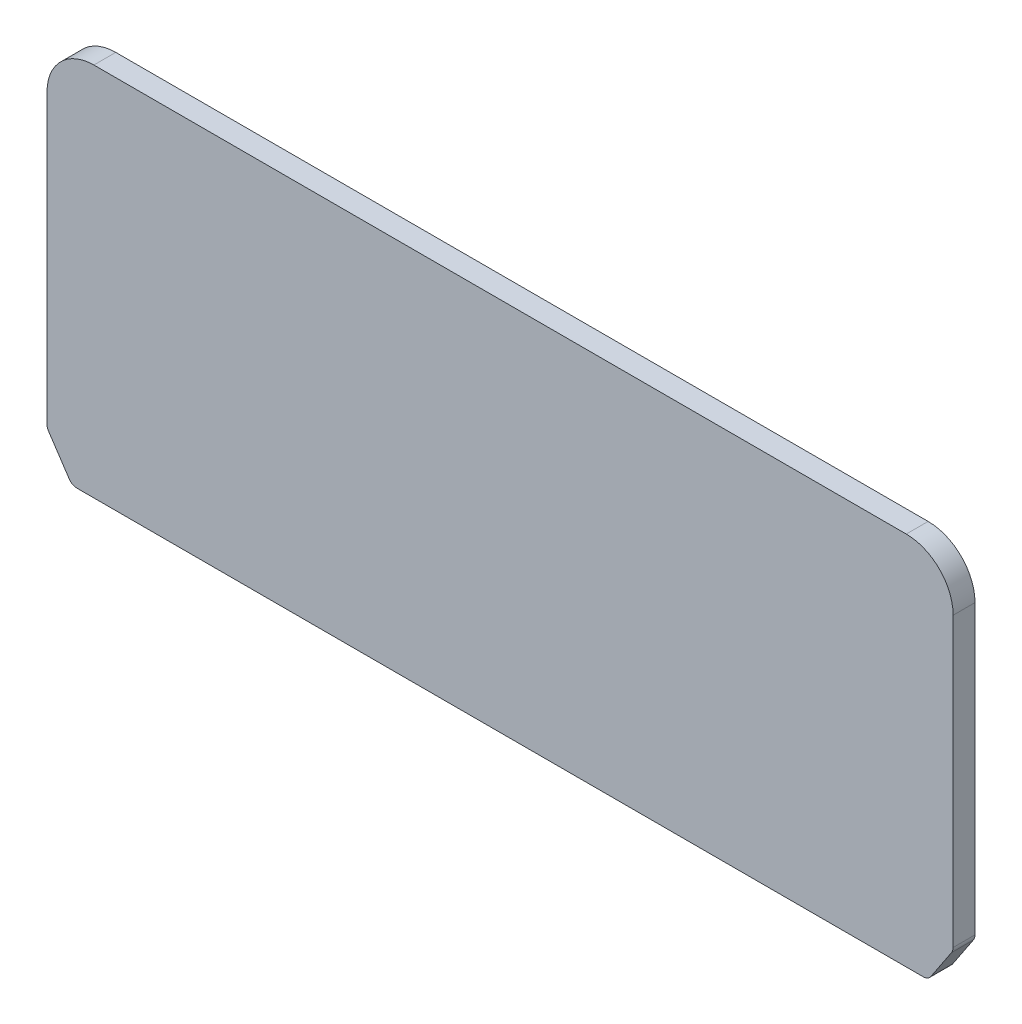
ISO-10303-21;
HEADER;
FILE_DESCRIPTION(('STEP AP214'),'2;1');
FILE_NAME('part.step','',(''),(''),'','','');
FILE_SCHEMA(('AUTOMOTIVE_DESIGN { 1 0 10303 214 1 1 1 1 }'));
ENDSEC;
DATA;
#1=APPLICATION_CONTEXT('core data for automotive mechanical design processes');
#2=APPLICATION_PROTOCOL_DEFINITION('international standard','automotive_design',2000,#1);
#3=PRODUCT_CONTEXT('',#1,'mechanical');
#4=PRODUCT('Part','Part','',(#3));
#5=PRODUCT_RELATED_PRODUCT_CATEGORY('part','',(#4));
#6=PRODUCT_DEFINITION_FORMATION('','',#4);
#7=PRODUCT_DEFINITION_CONTEXT('part definition',#1,'design');
#8=PRODUCT_DEFINITION('design','',#6,#7);
#9=PRODUCT_DEFINITION_SHAPE('','',#8);
#10=(LENGTH_UNIT() NAMED_UNIT(*) SI_UNIT(.MILLI.,.METRE.));
#11=(NAMED_UNIT(*) PLANE_ANGLE_UNIT() SI_UNIT($,.RADIAN.));
#12=(NAMED_UNIT(*) SI_UNIT($,.STERADIAN.) SOLID_ANGLE_UNIT());
#13=UNCERTAINTY_MEASURE_WITH_UNIT(LENGTH_MEASURE(1.E-05),#10,'distance_accuracy_value','');
#14=(GEOMETRIC_REPRESENTATION_CONTEXT(3) GLOBAL_UNCERTAINTY_ASSIGNED_CONTEXT((#13)) GLOBAL_UNIT_ASSIGNED_CONTEXT((#10,
#11,#12)) REPRESENTATION_CONTEXT('',''));
#15=CARTESIAN_POINT('',(0.,0.,0.));
#16=DIRECTION('',(0.,0.,1.));
#17=DIRECTION('',(1.,0.,0.));
#18=AXIS2_PLACEMENT_3D('',#15,#16,#17);
#19=CARTESIAN_POINT('',(-130.,105.,7.));
#20=DIRECTION('',(0.,0.,-1.));
#21=DIRECTION('',(-1.,0.,0.));
#22=AXIS2_PLACEMENT_3D('',#19,#20,#21);
#23=CYLINDRICAL_SURFACE('',#22,15.);
#24=CARTESIAN_POINT('',(-130.,105.,0.));
#25=DIRECTION('',(0.,0.,1.));
#26=DIRECTION('',(-1.,0.,0.));
#27=AXIS2_PLACEMENT_3D('',#24,#25,#26);
#28=CIRCLE('',#27,15.);
#29=CARTESIAN_POINT('',(-130.,120.,0.));
#30=VERTEX_POINT('',#29);
#31=CARTESIAN_POINT('',(-145.,105.,0.));
#32=VERTEX_POINT('',#31);
#33=EDGE_CURVE('E159',#30,#32,#28,.T.);
#34=ORIENTED_EDGE('',*,*,#33,.T.);
#35=DIRECTION('',(0.,0.,-1.));
#36=VECTOR('',#35,1.);
#37=CARTESIAN_POINT('',(-145.,105.,7.));
#38=LINE('',#37,#36);
#39=CARTESIAN_POINT('',(-145.,105.,7.));
#40=VERTEX_POINT('',#39);
#41=EDGE_CURVE('E11',#40,#32,#38,.T.);
#42=ORIENTED_EDGE('',*,*,#41,.F.);
#43=CARTESIAN_POINT('',(-130.,105.,7.));
#44=DIRECTION('',(0.,0.,1.));
#45=DIRECTION('',(-1.,0.,0.));
#46=AXIS2_PLACEMENT_3D('',#43,#44,#45);
#47=CIRCLE('',#46,15.);
#48=CARTESIAN_POINT('',(-130.,120.,7.));
#49=VERTEX_POINT('',#48);
#50=EDGE_CURVE('E181',#49,#40,#47,.T.);
#51=ORIENTED_EDGE('',*,*,#50,.F.);
#52=DIRECTION('',(0.,0.,-1.));
#53=VECTOR('',#52,1.);
#54=CARTESIAN_POINT('',(-130.,120.,7.));
#55=LINE('',#54,#53);
#56=EDGE_CURVE('E155',#49,#30,#55,.T.);
#57=ORIENTED_EDGE('',*,*,#56,.T.);
#58=EDGE_LOOP('',(#34,#42,#51,#57));
#59=FACE_BOUND('',#58,.T.);
#60=ADVANCED_FACE('F39',(#59),#23,.T.);
#61=CARTESIAN_POINT('',(-145.,12.908326913196,7.));
#62=DIRECTION('',(1.,0.,0.));
#63=DIRECTION('',(0.,1.,0.));
#64=AXIS2_PLACEMENT_3D('',#61,#62,#63);
#65=PLANE('',#64);
#66=DIRECTION('',(0.,-1.,0.));
#67=VECTOR('',#66,1.);
#68=CARTESIAN_POINT('',(-145.,12.908326913196,0.));
#69=LINE('',#68,#67);
#70=CARTESIAN_POINT('',(-145.,12.908326913196,0.));
#71=VERTEX_POINT('',#70);
#72=EDGE_CURVE('E162',#32,#71,#69,.T.);
#73=ORIENTED_EDGE('',*,*,#72,.T.);
#74=DIRECTION('',(0.,0.,-1.));
#75=VECTOR('',#74,1.);
#76=CARTESIAN_POINT('',(-145.,12.908326913196,7.));
#77=LINE('',#76,#75);
#78=CARTESIAN_POINT('',(-145.,12.908326913196,7.));
#79=VERTEX_POINT('',#78);
#80=EDGE_CURVE('E47',#79,#71,#77,.T.);
#81=ORIENTED_EDGE('',*,*,#80,.F.);
#82=DIRECTION('',(0.,-1.,0.));
#83=VECTOR('',#82,1.);
#84=CARTESIAN_POINT('',(-145.,12.908326913196,7.));
#85=LINE('',#84,#83);
#86=EDGE_CURVE('E110',#40,#79,#85,.T.);
#87=ORIENTED_EDGE('',*,*,#86,.F.);
#88=ORIENTED_EDGE('',*,*,#41,.T.);
#89=EDGE_LOOP('',(#73,#81,#87,#88));
#90=FACE_BOUND('',#89,.T.);
#91=ADVANCED_FACE('F259',(#90),#65,.F.);
#92=CARTESIAN_POINT('',(-142.,12.908326913196,7.));
#93=DIRECTION('',(0.,0.,-1.));
#94=DIRECTION('',(-1.,0.,0.));
#95=AXIS2_PLACEMENT_3D('',#92,#93,#94);
#96=CYLINDRICAL_SURFACE('',#95,3.);
#97=CARTESIAN_POINT('',(-142.,12.908326913196,0.));
#98=DIRECTION('',(0.,0.,1.));
#99=DIRECTION('',(-1.,0.,0.));
#100=AXIS2_PLACEMENT_3D('',#97,#98,#99);
#101=CIRCLE('',#100,3.);
#102=CARTESIAN_POINT('',(-144.496150883014,11.2442263245203,0.));
#103=VERTEX_POINT('',#102);
#104=EDGE_CURVE('E164',#71,#103,#101,.T.);
#105=ORIENTED_EDGE('',*,*,#104,.T.);
#106=DIRECTION('',(0.,0.,-1.));
#107=VECTOR('',#106,1.);
#108=CARTESIAN_POINT('',(-144.496150883014,11.2442263245203,7.));
#109=LINE('',#108,#107);
#110=CARTESIAN_POINT('',(-144.496150883014,11.2442263245203,7.));
#111=VERTEX_POINT('',#110);
#112=EDGE_CURVE('E200',#111,#103,#109,.T.);
#113=ORIENTED_EDGE('',*,*,#112,.F.);
#114=CARTESIAN_POINT('',(-142.,12.908326913196,7.));
#115=DIRECTION('',(0.,0.,1.));
#116=DIRECTION('',(-1.,0.,0.));
#117=AXIS2_PLACEMENT_3D('',#114,#115,#116);
#118=CIRCLE('',#117,3.);
#119=EDGE_CURVE('E208',#79,#111,#118,.T.);
#120=ORIENTED_EDGE('',*,*,#119,.F.);
#121=ORIENTED_EDGE('',*,*,#80,.T.);
#122=EDGE_LOOP('',(#105,#113,#120,#121));
#123=FACE_BOUND('',#122,.T.);
#124=ADVANCED_FACE('F206',(#123),#96,.T.);
#125=CARTESIAN_POINT('',(-144.496150883014,11.2442263245203,7.));
#126=DIRECTION('',(0.832050294337845,0.554700196225227,0.));
#127=DIRECTION('',(-0.554700196225227,0.832050294337845,0.));
#128=AXIS2_PLACEMENT_3D('',#125,#126,#127);
#129=PLANE('',#128);
#130=DIRECTION('',(0.554700196225227,-0.832050294337845,0.));
#131=VECTOR('',#130,1.);
#132=CARTESIAN_POINT('',(-144.496150883014,11.2442263245203,0.));
#133=LINE('',#132,#131);
#134=CARTESIAN_POINT('',(-137.89059960755,1.33589941132433,0.));
#135=VERTEX_POINT('',#134);
#136=EDGE_CURVE('E166',#103,#135,#133,.T.);
#137=ORIENTED_EDGE('',*,*,#136,.T.);
#138=DIRECTION('',(0.,0.,-1.));
#139=VECTOR('',#138,1.);
#140=CARTESIAN_POINT('',(-137.89059960755,1.33589941132433,7.));
#141=LINE('',#140,#139);
#142=CARTESIAN_POINT('',(-137.89059960755,1.33589941132433,7.));
#143=VERTEX_POINT('',#142);
#144=EDGE_CURVE('E197',#143,#135,#141,.T.);
#145=ORIENTED_EDGE('',*,*,#144,.F.);
#146=DIRECTION('',(0.554700196225227,-0.832050294337845,0.));
#147=VECTOR('',#146,1.);
#148=CARTESIAN_POINT('',(-144.496150883014,11.2442263245203,7.));
#149=LINE('',#148,#147);
#150=EDGE_CURVE('E226',#111,#143,#149,.T.);
#151=ORIENTED_EDGE('',*,*,#150,.F.);
#152=ORIENTED_EDGE('',*,*,#112,.T.);
#153=EDGE_LOOP('',(#137,#145,#151,#152));
#154=FACE_BOUND('',#153,.T.);
#155=ADVANCED_FACE('F217',(#154),#129,.F.);
#156=CARTESIAN_POINT('',(-135.394448724536,3.,7.));
#157=DIRECTION('',(0.,0.,-1.));
#158=DIRECTION('',(-1.,0.,0.));
#159=AXIS2_PLACEMENT_3D('',#156,#157,#158);
#160=CYLINDRICAL_SURFACE('',#159,3.00000000000001);
#161=CARTESIAN_POINT('',(-135.394448724536,3.,0.));
#162=DIRECTION('',(0.,0.,1.));
#163=DIRECTION('',(1.,0.,0.));
#164=AXIS2_PLACEMENT_3D('',#161,#162,#163);
#165=CIRCLE('',#164,3.00000000000001);
#166=CARTESIAN_POINT('',(-135.394448724536,0.,0.));
#167=VERTEX_POINT('',#166);
#168=EDGE_CURVE('E168',#135,#167,#165,.T.);
#169=ORIENTED_EDGE('',*,*,#168,.T.);
#170=DIRECTION('',(0.,0.,-1.));
#171=VECTOR('',#170,1.);
#172=CARTESIAN_POINT('',(-135.394448724536,0.,7.));
#173=LINE('',#172,#171);
#174=CARTESIAN_POINT('',(-135.394448724536,0.,7.));
#175=VERTEX_POINT('',#174);
#176=EDGE_CURVE('E194',#175,#167,#173,.T.);
#177=ORIENTED_EDGE('',*,*,#176,.F.);
#178=CARTESIAN_POINT('',(-135.394448724536,3.,7.));
#179=DIRECTION('',(0.,0.,1.));
#180=DIRECTION('',(1.,0.,0.));
#181=AXIS2_PLACEMENT_3D('',#178,#179,#180);
#182=CIRCLE('',#181,3.00000000000001);
#183=EDGE_CURVE('E223',#143,#175,#182,.T.);
#184=ORIENTED_EDGE('',*,*,#183,.F.);
#185=ORIENTED_EDGE('',*,*,#144,.T.);
#186=EDGE_LOOP('',(#169,#177,#184,#185));
#187=FACE_BOUND('',#186,.T.);
#188=ADVANCED_FACE('F221',(#187),#160,.T.);
#189=CARTESIAN_POINT('',(-135.394448724536,0.,7.));
#190=DIRECTION('',(0.,1.,0.));
#191=DIRECTION('',(0.,0.,1.));
#192=AXIS2_PLACEMENT_3D('',#189,#190,#191);
#193=PLANE('',#192);
#194=DIRECTION('',(1.,0.,0.));
#195=VECTOR('',#194,1.);
#196=CARTESIAN_POINT('',(-135.394448724536,0.,0.));
#197=LINE('',#196,#195);
#198=CARTESIAN_POINT('',(135.394448724536,0.,0.));
#199=VERTEX_POINT('',#198);
#200=EDGE_CURVE('E170',#167,#199,#197,.T.);
#201=ORIENTED_EDGE('',*,*,#200,.T.);
#202=DIRECTION('',(0.,0.,-1.));
#203=VECTOR('',#202,1.);
#204=CARTESIAN_POINT('',(135.394448724536,0.,7.));
#205=LINE('',#204,#203);
#206=CARTESIAN_POINT('',(135.394448724536,0.,7.));
#207=VERTEX_POINT('',#206);
#208=EDGE_CURVE('E191',#207,#199,#205,.T.);
#209=ORIENTED_EDGE('',*,*,#208,.F.);
#210=DIRECTION('',(1.,0.,0.));
#211=VECTOR('',#210,1.);
#212=CARTESIAN_POINT('',(-135.394448724536,0.,7.));
#213=LINE('',#212,#211);
#214=EDGE_CURVE('E225',#175,#207,#213,.T.);
#215=ORIENTED_EDGE('',*,*,#214,.F.);
#216=ORIENTED_EDGE('',*,*,#176,.T.);
#217=EDGE_LOOP('',(#201,#209,#215,#216));
#218=FACE_BOUND('',#217,.T.);
#219=ADVANCED_FACE('F272',(#218),#193,.F.);
#220=CARTESIAN_POINT('',(135.394448724536,3.,7.));
#221=DIRECTION('',(0.,0.,-1.));
#222=DIRECTION('',(-1.,0.,0.));
#223=AXIS2_PLACEMENT_3D('',#220,#221,#222);
#224=CYLINDRICAL_SURFACE('',#223,3.00000000000001);
#225=CARTESIAN_POINT('',(135.394448724536,3.,0.));
#226=DIRECTION('',(0.,0.,1.));
#227=DIRECTION('',(-1.,0.,0.));
#228=AXIS2_PLACEMENT_3D('',#225,#226,#227);
#229=CIRCLE('',#228,3.00000000000001);
#230=CARTESIAN_POINT('',(137.89059960755,1.33589941132433,0.));
#231=VERTEX_POINT('',#230);
#232=EDGE_CURVE('E172',#199,#231,#229,.T.);
#233=ORIENTED_EDGE('',*,*,#232,.T.);
#234=DIRECTION('',(0.,0.,-1.));
#235=VECTOR('',#234,1.);
#236=CARTESIAN_POINT('',(137.89059960755,1.33589941132433,7.));
#237=LINE('',#236,#235);
#238=CARTESIAN_POINT('',(137.89059960755,1.33589941132433,7.));
#239=VERTEX_POINT('',#238);
#240=EDGE_CURVE('E188',#239,#231,#237,.T.);
#241=ORIENTED_EDGE('',*,*,#240,.F.);
#242=CARTESIAN_POINT('',(135.394448724536,3.,7.));
#243=DIRECTION('',(0.,0.,1.));
#244=DIRECTION('',(-1.,0.,0.));
#245=AXIS2_PLACEMENT_3D('',#242,#243,#244);
#246=CIRCLE('',#245,3.00000000000001);
#247=EDGE_CURVE('E228',#207,#239,#246,.T.);
#248=ORIENTED_EDGE('',*,*,#247,.F.);
#249=ORIENTED_EDGE('',*,*,#208,.T.);
#250=EDGE_LOOP('',(#233,#241,#248,#249));
#251=FACE_BOUND('',#250,.T.);
#252=ADVANCED_FACE('F275',(#251),#224,.T.);
#253=CARTESIAN_POINT('',(144.496150883014,11.2442263245203,7.));
#254=DIRECTION('',(-0.832050294337845,0.554700196225227,0.));
#255=DIRECTION('',(-0.554700196225227,-0.832050294337845,0.));
#256=AXIS2_PLACEMENT_3D('',#253,#254,#255);
#257=PLANE('',#256);
#258=DIRECTION('',(0.554700196225227,0.832050294337845,0.));
#259=VECTOR('',#258,1.);
#260=CARTESIAN_POINT('',(144.496150883014,11.2442263245203,0.));
#261=LINE('',#260,#259);
#262=CARTESIAN_POINT('',(144.496150883014,11.2442263245203,0.));
#263=VERTEX_POINT('',#262);
#264=EDGE_CURVE('E174',#231,#263,#261,.T.);
#265=ORIENTED_EDGE('',*,*,#264,.T.);
#266=DIRECTION('',(0.,0.,-1.));
#267=VECTOR('',#266,1.);
#268=CARTESIAN_POINT('',(144.496150883014,11.2442263245203,7.));
#269=LINE('',#268,#267);
#270=CARTESIAN_POINT('',(144.496150883014,11.2442263245203,7.));
#271=VERTEX_POINT('',#270);
#272=EDGE_CURVE('E185',#271,#263,#269,.T.);
#273=ORIENTED_EDGE('',*,*,#272,.F.);
#274=DIRECTION('',(0.554700196225227,0.832050294337845,0.));
#275=VECTOR('',#274,1.);
#276=CARTESIAN_POINT('',(144.496150883014,11.2442263245203,7.));
#277=LINE('',#276,#275);
#278=EDGE_CURVE('E234',#239,#271,#277,.T.);
#279=ORIENTED_EDGE('',*,*,#278,.F.);
#280=ORIENTED_EDGE('',*,*,#240,.T.);
#281=EDGE_LOOP('',(#265,#273,#279,#280));
#282=FACE_BOUND('',#281,.T.);
#283=ADVANCED_FACE('F240',(#282),#257,.F.);
#284=CARTESIAN_POINT('',(142.,12.908326913196,7.));
#285=DIRECTION('',(0.,0.,-1.));
#286=DIRECTION('',(-1.,0.,0.));
#287=AXIS2_PLACEMENT_3D('',#284,#285,#286);
#288=CYLINDRICAL_SURFACE('',#287,3.);
#289=CARTESIAN_POINT('',(142.,12.908326913196,0.));
#290=DIRECTION('',(0.,0.,1.));
#291=DIRECTION('',(1.,0.,0.));
#292=AXIS2_PLACEMENT_3D('',#289,#290,#291);
#293=CIRCLE('',#292,3.);
#294=CARTESIAN_POINT('',(145.,12.908326913196,0.));
#295=VERTEX_POINT('',#294);
#296=EDGE_CURVE('E176',#263,#295,#293,.T.);
#297=ORIENTED_EDGE('',*,*,#296,.T.);
#298=DIRECTION('',(0.,0.,-1.));
#299=VECTOR('',#298,1.);
#300=CARTESIAN_POINT('',(145.,12.908326913196,7.));
#301=LINE('',#300,#299);
#302=CARTESIAN_POINT('',(145.,12.908326913196,7.));
#303=VERTEX_POINT('',#302);
#304=EDGE_CURVE('E150',#303,#295,#301,.T.);
#305=ORIENTED_EDGE('',*,*,#304,.F.);
#306=CARTESIAN_POINT('',(142.,12.908326913196,7.));
#307=DIRECTION('',(0.,0.,1.));
#308=DIRECTION('',(1.,0.,0.));
#309=AXIS2_PLACEMENT_3D('',#306,#307,#308);
#310=CIRCLE('',#309,3.);
#311=EDGE_CURVE('E141',#271,#303,#310,.T.);
#312=ORIENTED_EDGE('',*,*,#311,.F.);
#313=ORIENTED_EDGE('',*,*,#272,.T.);
#314=EDGE_LOOP('',(#297,#305,#312,#313));
#315=FACE_BOUND('',#314,.T.);
#316=ADVANCED_FACE('F244',(#315),#288,.T.);
#317=CARTESIAN_POINT('',(145.,12.908326913196,7.));
#318=DIRECTION('',(-1.,0.,0.));
#319=DIRECTION('',(0.,-1.,0.));
#320=AXIS2_PLACEMENT_3D('',#317,#318,#319);
#321=PLANE('',#320);
#322=DIRECTION('',(0.,1.,0.));
#323=VECTOR('',#322,1.);
#324=CARTESIAN_POINT('',(145.,12.908326913196,0.));
#325=LINE('',#324,#323);
#326=CARTESIAN_POINT('',(145.,105.,0.));
#327=VERTEX_POINT('',#326);
#328=EDGE_CURVE('E149',#295,#327,#325,.T.);
#329=ORIENTED_EDGE('',*,*,#328,.T.);
#330=DIRECTION('',(0.,0.,-1.));
#331=VECTOR('',#330,1.);
#332=CARTESIAN_POINT('',(145.,105.,7.));
#333=LINE('',#332,#331);
#334=CARTESIAN_POINT('',(145.,105.,7.));
#335=VERTEX_POINT('',#334);
#336=EDGE_CURVE('E146',#335,#327,#333,.T.);
#337=ORIENTED_EDGE('',*,*,#336,.F.);
#338=DIRECTION('',(0.,1.,0.));
#339=VECTOR('',#338,1.);
#340=CARTESIAN_POINT('',(145.,12.908326913196,7.));
#341=LINE('',#340,#339);
#342=EDGE_CURVE('E135',#303,#335,#341,.T.);
#343=ORIENTED_EDGE('',*,*,#342,.F.);
#344=ORIENTED_EDGE('',*,*,#304,.T.);
#345=EDGE_LOOP('',(#329,#337,#343,#344));
#346=FACE_BOUND('',#345,.T.);
#347=ADVANCED_FACE('F147',(#346),#321,.F.);
#348=CARTESIAN_POINT('',(130.,105.,7.));
#349=DIRECTION('',(0.,0.,-1.));
#350=DIRECTION('',(-1.,0.,0.));
#351=AXIS2_PLACEMENT_3D('',#348,#349,#350);
#352=CYLINDRICAL_SURFACE('',#351,15.);
#353=CARTESIAN_POINT('',(130.,105.,0.));
#354=DIRECTION('',(0.,0.,1.));
#355=DIRECTION('',(-1.,0.,0.));
#356=AXIS2_PLACEMENT_3D('',#353,#354,#355);
#357=CIRCLE('',#356,15.);
#358=CARTESIAN_POINT('',(130.,120.,0.));
#359=VERTEX_POINT('',#358);
#360=EDGE_CURVE('E96',#327,#359,#357,.T.);
#361=ORIENTED_EDGE('',*,*,#360,.T.);
#362=DIRECTION('',(0.,0.,-1.));
#363=VECTOR('',#362,1.);
#364=CARTESIAN_POINT('',(130.,120.,7.));
#365=LINE('',#364,#363);
#366=CARTESIAN_POINT('',(130.,120.,7.));
#367=VERTEX_POINT('',#366);
#368=EDGE_CURVE('E151',#367,#359,#365,.T.);
#369=ORIENTED_EDGE('',*,*,#368,.F.);
#370=CARTESIAN_POINT('',(130.,105.,7.));
#371=DIRECTION('',(0.,0.,1.));
#372=DIRECTION('',(-1.,0.,0.));
#373=AXIS2_PLACEMENT_3D('',#370,#371,#372);
#374=CIRCLE('',#373,15.);
#375=EDGE_CURVE('E139',#335,#367,#374,.T.);
#376=ORIENTED_EDGE('',*,*,#375,.F.);
#377=ORIENTED_EDGE('',*,*,#336,.T.);
#378=EDGE_LOOP('',(#361,#369,#376,#377));
#379=FACE_BOUND('',#378,.T.);
#380=ADVANCED_FACE('F153',(#379),#352,.T.);
#381=CARTESIAN_POINT('',(-130.,120.,7.));
#382=DIRECTION('',(0.,-1.,0.));
#383=DIRECTION('',(0.,0.,-1.));
#384=AXIS2_PLACEMENT_3D('',#381,#382,#383);
#385=PLANE('',#384);
#386=DIRECTION('',(-1.,0.,0.));
#387=VECTOR('',#386,1.);
#388=CARTESIAN_POINT('',(-130.,120.,0.));
#389=LINE('',#388,#387);
#390=EDGE_CURVE('E102',#359,#30,#389,.T.);
#391=ORIENTED_EDGE('',*,*,#390,.T.);
#392=ORIENTED_EDGE('',*,*,#56,.F.);
#393=DIRECTION('',(-1.,0.,0.));
#394=VECTOR('',#393,1.);
#395=CARTESIAN_POINT('',(-130.,120.,7.));
#396=LINE('',#395,#394);
#397=EDGE_CURVE('E55',#367,#49,#396,.T.);
#398=ORIENTED_EDGE('',*,*,#397,.F.);
#399=ORIENTED_EDGE('',*,*,#368,.T.);
#400=EDGE_LOOP('',(#391,#392,#398,#399));
#401=FACE_BOUND('',#400,.T.);
#402=ADVANCED_FACE('F248',(#401),#385,.F.);
#403=CARTESIAN_POINT('',(-130.,105.,7.));
#404=DIRECTION('',(0.,0.,-1.));
#405=DIRECTION('',(-1.,0.,0.));
#406=AXIS2_PLACEMENT_3D('',#403,#404,#405);
#407=PLANE('',#406);
#408=ORIENTED_EDGE('',*,*,#50,.T.);
#409=ORIENTED_EDGE('',*,*,#86,.T.);
#410=ORIENTED_EDGE('',*,*,#119,.T.);
#411=ORIENTED_EDGE('',*,*,#150,.T.);
#412=ORIENTED_EDGE('',*,*,#183,.T.);
#413=ORIENTED_EDGE('',*,*,#214,.T.);
#414=ORIENTED_EDGE('',*,*,#247,.T.);
#415=ORIENTED_EDGE('',*,*,#278,.T.);
#416=ORIENTED_EDGE('',*,*,#311,.T.);
#417=ORIENTED_EDGE('',*,*,#342,.T.);
#418=ORIENTED_EDGE('',*,*,#375,.T.);
#419=ORIENTED_EDGE('',*,*,#397,.T.);
#420=EDGE_LOOP('',(#408,#409,#410,#411,#412,#413,#414,#415,#416,#417,#418,#419));
#421=FACE_BOUND('',#420,.T.);
#422=ADVANCED_FACE('F137',(#421),#407,.F.);
#423=CARTESIAN_POINT('',(-130.,105.,0.));
#424=DIRECTION('',(0.,0.,-1.));
#425=DIRECTION('',(-1.,0.,0.));
#426=AXIS2_PLACEMENT_3D('',#423,#424,#425);
#427=PLANE('',#426);
#428=ORIENTED_EDGE('',*,*,#33,.F.);
#429=ORIENTED_EDGE('',*,*,#390,.F.);
#430=ORIENTED_EDGE('',*,*,#360,.F.);
#431=ORIENTED_EDGE('',*,*,#328,.F.);
#432=ORIENTED_EDGE('',*,*,#296,.F.);
#433=ORIENTED_EDGE('',*,*,#264,.F.);
#434=ORIENTED_EDGE('',*,*,#232,.F.);
#435=ORIENTED_EDGE('',*,*,#200,.F.);
#436=ORIENTED_EDGE('',*,*,#168,.F.);
#437=ORIENTED_EDGE('',*,*,#136,.F.);
#438=ORIENTED_EDGE('',*,*,#104,.F.);
#439=ORIENTED_EDGE('',*,*,#72,.F.);
#440=EDGE_LOOP('',(#428,#429,#430,#431,#432,#433,#434,#435,#436,#437,#438,#439));
#441=FACE_BOUND('',#440,.T.);
#442=ADVANCED_FACE('F212',(#441),#427,.T.);
#443=CLOSED_SHELL('',(#60,#91,#124,#155,#188,#219,#252,#283,#316,#347,#380,#402,#422,#442));
#444=MANIFOLD_SOLID_BREP('B2',#443);
#445=ADVANCED_BREP_SHAPE_REPRESENTATION('',(#18,#444),#14);
#446=SHAPE_DEFINITION_REPRESENTATION(#9,#445);
ENDSEC;
END-ISO-10303-21;
